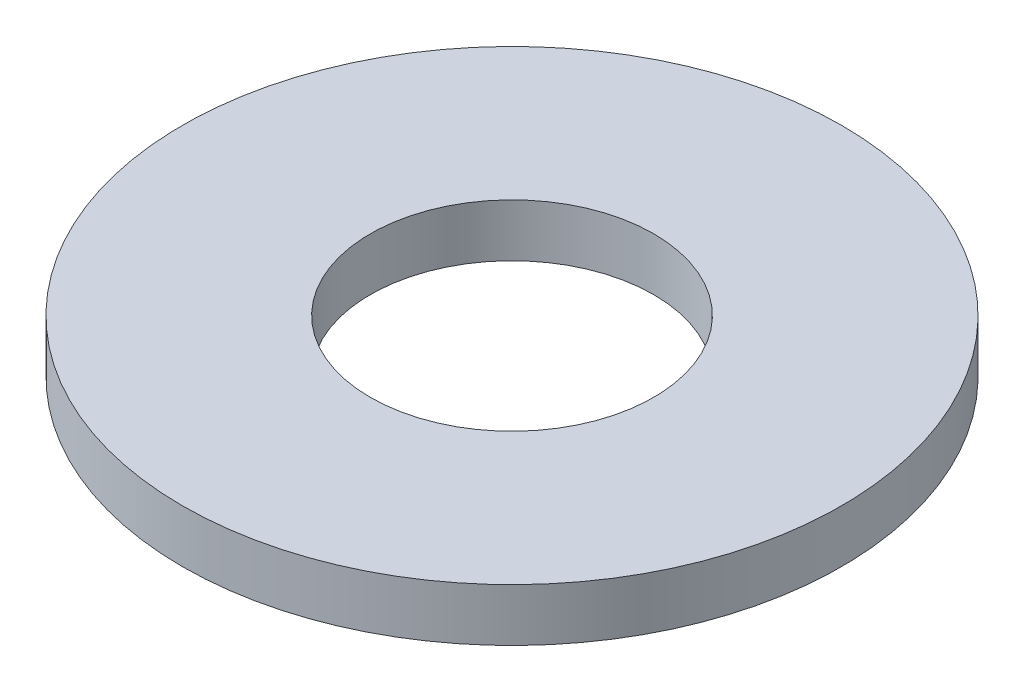
ISO-10303-21;
HEADER;
FILE_DESCRIPTION(('STEP AP214'),'2;1');
FILE_NAME('part.step','',(''),(''),'','','');
FILE_SCHEMA(('AUTOMOTIVE_DESIGN { 1 0 10303 214 1 1 1 1 }'));
ENDSEC;
DATA;
#1=APPLICATION_CONTEXT('core data for automotive mechanical design processes');
#2=APPLICATION_PROTOCOL_DEFINITION('international standard','automotive_design',2000,#1);
#3=PRODUCT_CONTEXT('',#1,'mechanical');
#4=PRODUCT('Part','Part','',(#3));
#5=PRODUCT_RELATED_PRODUCT_CATEGORY('part','',(#4));
#6=PRODUCT_DEFINITION_FORMATION('','',#4);
#7=PRODUCT_DEFINITION_CONTEXT('part definition',#1,'design');
#8=PRODUCT_DEFINITION('design','',#6,#7);
#9=PRODUCT_DEFINITION_SHAPE('','',#8);
#10=(LENGTH_UNIT() NAMED_UNIT(*) SI_UNIT(.MILLI.,.METRE.));
#11=(NAMED_UNIT(*) PLANE_ANGLE_UNIT() SI_UNIT($,.RADIAN.));
#12=(NAMED_UNIT(*) SI_UNIT($,.STERADIAN.) SOLID_ANGLE_UNIT());
#13=UNCERTAINTY_MEASURE_WITH_UNIT(LENGTH_MEASURE(1.E-05),#10,'distance_accuracy_value','');
#14=(GEOMETRIC_REPRESENTATION_CONTEXT(3) GLOBAL_UNCERTAINTY_ASSIGNED_CONTEXT((#13)) GLOBAL_UNIT_ASSIGNED_CONTEXT((#10,
#11,#12)) REPRESENTATION_CONTEXT('',''));
#15=CARTESIAN_POINT('',(0.,0.,0.));
#16=DIRECTION('',(0.,0.,1.));
#17=DIRECTION('',(1.,0.,0.));
#18=AXIS2_PLACEMENT_3D('',#15,#16,#17);
#19=CARTESIAN_POINT('',(0.,0.8,0.));
#20=DIRECTION('',(0.,1.,0.));
#21=DIRECTION('',(0.,0.,1.));
#22=AXIS2_PLACEMENT_3D('',#19,#20,#21);
#23=PLANE('',#22);
#24=CARTESIAN_POINT('',(0.,0.8,0.));
#25=DIRECTION('',(0.,1.,0.));
#26=DIRECTION('',(0.,0.,1.));
#27=AXIS2_PLACEMENT_3D('',#24,#25,#26);
#28=CIRCLE('',#27,5.);
#29=CARTESIAN_POINT('',(0.,0.8,5.));
#30=VERTEX_POINT('',#29);
#31=EDGE_CURVE('E10',#30,#30,#28,.T.);
#32=ORIENTED_EDGE('',*,*,#31,.T.);
#33=EDGE_LOOP('',(#32));
#34=FACE_BOUND('',#33,.T.);
#35=CARTESIAN_POINT('',(0.,0.8,0.));
#36=DIRECTION('',(0.,1.,0.));
#37=DIRECTION('',(0.,0.,1.));
#38=AXIS2_PLACEMENT_3D('',#35,#36,#37);
#39=CIRCLE('',#38,2.15);
#40=CARTESIAN_POINT('',(0.,0.8,2.15));
#41=VERTEX_POINT('',#40);
#42=EDGE_CURVE('E46',#41,#41,#39,.T.);
#43=ORIENTED_EDGE('',*,*,#42,.F.);
#44=EDGE_LOOP('',(#43));
#45=FACE_BOUND('',#44,.T.);
#46=ADVANCED_FACE('F35',(#34,#45),#23,.T.);
#47=CARTESIAN_POINT('',(0.,0.,0.));
#48=DIRECTION('',(0.,1.,0.));
#49=DIRECTION('',(0.,0.,1.));
#50=AXIS2_PLACEMENT_3D('',#47,#48,#49);
#51=PLANE('',#50);
#52=CARTESIAN_POINT('',(0.,0.,0.));
#53=DIRECTION('',(0.,1.,0.));
#54=DIRECTION('',(0.,0.,1.));
#55=AXIS2_PLACEMENT_3D('',#52,#53,#54);
#56=CIRCLE('',#55,5.);
#57=CARTESIAN_POINT('',(0.,0.,5.));
#58=VERTEX_POINT('',#57);
#59=EDGE_CURVE('E39',#58,#58,#56,.T.);
#60=ORIENTED_EDGE('',*,*,#59,.F.);
#61=EDGE_LOOP('',(#60));
#62=FACE_BOUND('',#61,.T.);
#63=CARTESIAN_POINT('',(0.,0.,0.));
#64=DIRECTION('',(0.,1.,0.));
#65=DIRECTION('',(0.,0.,1.));
#66=AXIS2_PLACEMENT_3D('',#63,#64,#65);
#67=CIRCLE('',#66,2.15);
#68=CARTESIAN_POINT('',(0.,0.,2.15));
#69=VERTEX_POINT('',#68);
#70=EDGE_CURVE('E48',#69,#69,#67,.T.);
#71=ORIENTED_EDGE('',*,*,#70,.T.);
#72=EDGE_LOOP('',(#71));
#73=FACE_BOUND('',#72,.T.);
#74=ADVANCED_FACE('F58',(#62,#73),#51,.F.);
#75=CARTESIAN_POINT('',(0.,0.8,0.));
#76=DIRECTION('',(0.,-1.,0.));
#77=DIRECTION('',(0.,0.,-1.));
#78=AXIS2_PLACEMENT_3D('',#75,#76,#77);
#79=CYLINDRICAL_SURFACE('',#78,5.);
#80=ORIENTED_EDGE('',*,*,#31,.F.);
#81=EDGE_LOOP('',(#80));
#82=FACE_BOUND('',#81,.T.);
#83=ORIENTED_EDGE('',*,*,#59,.T.);
#84=EDGE_LOOP('',(#83));
#85=FACE_BOUND('',#84,.T.);
#86=ADVANCED_FACE('F37',(#82,#85),#79,.T.);
#87=CARTESIAN_POINT('',(0.,0.8,0.));
#88=DIRECTION('',(0.,-1.,0.));
#89=DIRECTION('',(0.,0.,-1.));
#90=AXIS2_PLACEMENT_3D('',#87,#88,#89);
#91=CYLINDRICAL_SURFACE('',#90,2.15);
#92=ORIENTED_EDGE('',*,*,#42,.T.);
#93=EDGE_LOOP('',(#92));
#94=FACE_BOUND('',#93,.T.);
#95=ORIENTED_EDGE('',*,*,#70,.F.);
#96=EDGE_LOOP('',(#95));
#97=FACE_BOUND('',#96,.T.);
#98=ADVANCED_FACE('F54',(#94,#97),#91,.F.);
#99=CLOSED_SHELL('',(#46,#74,#86,#98));
#100=MANIFOLD_SOLID_BREP('B2',#99);
#101=ADVANCED_BREP_SHAPE_REPRESENTATION('',(#18,#100),#14);
#102=SHAPE_DEFINITION_REPRESENTATION(#9,#101);
ENDSEC;
END-ISO-10303-21;
